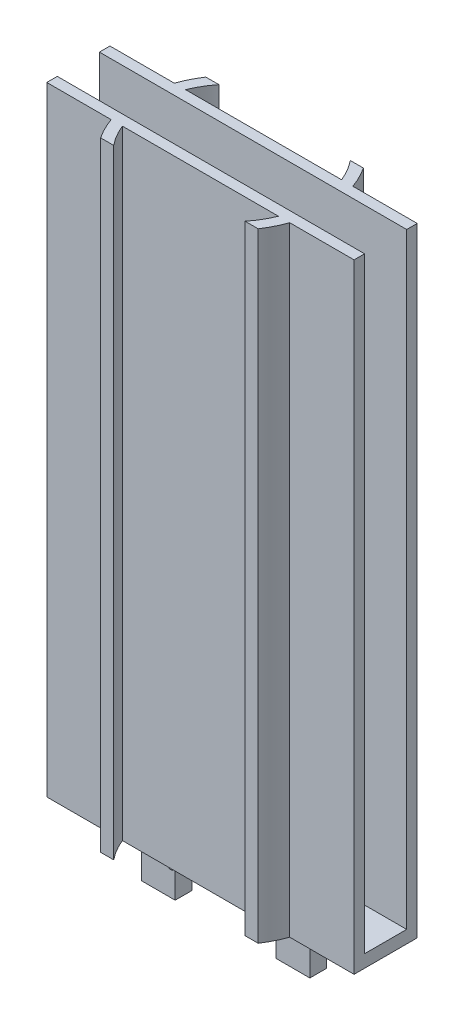
ISO-10303-21;
HEADER;
FILE_DESCRIPTION(('STEP AP214'),'2;1');
FILE_NAME('part.step','',(''),(''),'','','');
FILE_SCHEMA(('AUTOMOTIVE_DESIGN { 1 0 10303 214 1 1 1 1 }'));
ENDSEC;
DATA;
#1=APPLICATION_CONTEXT('core data for automotive mechanical design processes');
#2=APPLICATION_PROTOCOL_DEFINITION('international standard','automotive_design',2000,#1);
#3=PRODUCT_CONTEXT('',#1,'mechanical');
#4=PRODUCT('Part','Part','',(#3));
#5=PRODUCT_RELATED_PRODUCT_CATEGORY('part','',(#4));
#6=PRODUCT_DEFINITION_FORMATION('','',#4);
#7=PRODUCT_DEFINITION_CONTEXT('part definition',#1,'design');
#8=PRODUCT_DEFINITION('design','',#6,#7);
#9=PRODUCT_DEFINITION_SHAPE('','',#8);
#10=(LENGTH_UNIT() NAMED_UNIT(*) SI_UNIT(.MILLI.,.METRE.));
#11=(NAMED_UNIT(*) PLANE_ANGLE_UNIT() SI_UNIT($,.RADIAN.));
#12=(NAMED_UNIT(*) SI_UNIT($,.STERADIAN.) SOLID_ANGLE_UNIT());
#13=UNCERTAINTY_MEASURE_WITH_UNIT(LENGTH_MEASURE(1.E-05),#10,'distance_accuracy_value','');
#14=(GEOMETRIC_REPRESENTATION_CONTEXT(3) GLOBAL_UNCERTAINTY_ASSIGNED_CONTEXT((#13)) GLOBAL_UNIT_ASSIGNED_CONTEXT((#10,
#11,#12)) REPRESENTATION_CONTEXT('',''));
#15=CARTESIAN_POINT('',(0.,0.,0.));
#16=DIRECTION('',(0.,0.,1.));
#17=DIRECTION('',(1.,0.,0.));
#18=AXIS2_PLACEMENT_3D('',#15,#16,#17);
#19=CARTESIAN_POINT('',(0.,0.,0.));
#20=DIRECTION('',(0.,1.,0.));
#21=DIRECTION('',(0.,0.,1.));
#22=AXIS2_PLACEMENT_3D('',#19,#20,#21);
#23=PLANE('',#22);
#24=DIRECTION('',(0.,0.,-1.));
#25=VECTOR('',#24,1.);
#26=CARTESIAN_POINT('',(-73.,0.,0.));
#27=LINE('',#26,#25);
#28=CARTESIAN_POINT('',(-73.,0.,0.));
#29=VERTEX_POINT('',#28);
#30=CARTESIAN_POINT('',(-73.,0.,-10.));
#31=VERTEX_POINT('',#30);
#32=EDGE_CURVE('E409',#29,#31,#27,.T.);
#33=ORIENTED_EDGE('',*,*,#32,.F.);
#34=DIRECTION('',(-1.,0.,0.));
#35=VECTOR('',#34,1.);
#36=CARTESIAN_POINT('',(0.,0.,0.));
#37=LINE('',#36,#35);
#38=CARTESIAN_POINT('',(0.,0.,0.));
#39=VERTEX_POINT('',#38);
#40=EDGE_CURVE('E317',#39,#29,#37,.T.);
#41=ORIENTED_EDGE('',*,*,#40,.F.);
#42=DIRECTION('',(0.,0.,-1.));
#43=VECTOR('',#42,1.);
#44=CARTESIAN_POINT('',(0.,0.,0.));
#45=LINE('',#44,#43);
#46=CARTESIAN_POINT('',(0.,0.,-10.));
#47=VERTEX_POINT('',#46);
#48=EDGE_CURVE('E404',#39,#47,#45,.T.);
#49=ORIENTED_EDGE('',*,*,#48,.T.);
#50=DIRECTION('',(-1.,0.,0.));
#51=VECTOR('',#50,1.);
#52=CARTESIAN_POINT('',(0.,0.,-10.));
#53=LINE('',#52,#51);
#54=EDGE_CURVE('E359',#47,#31,#53,.T.);
#55=ORIENTED_EDGE('',*,*,#54,.T.);
#56=EDGE_LOOP('',(#33,#41,#49,#55));
#57=FACE_BOUND('',#56,.T.);
#58=ADVANCED_FACE('F39',(#57),#23,.T.);
#59=CARTESIAN_POINT('',(0.,-3.,2.49999999999999));
#60=DIRECTION('',(0.,0.,1.));
#61=DIRECTION('',(1.,0.,0.));
#62=AXIS2_PLACEMENT_3D('',#59,#60,#61);
#63=PLANE('',#62);
#64=DIRECTION('',(0.,1.,0.));
#65=VECTOR('',#64,1.);
#66=CARTESIAN_POINT('',(-17.9595037822608,-3.,2.49999999999999));
#67=LINE('',#66,#65);
#68=CARTESIAN_POINT('',(-17.9595037822608,-3.,2.49999999999999));
#69=VERTEX_POINT('',#68);
#70=CARTESIAN_POINT('',(-17.9595037822608,144.,2.49999999999999));
#71=VERTEX_POINT('',#70);
#72=EDGE_CURVE('E43',#69,#71,#67,.T.);
#73=ORIENTED_EDGE('',*,*,#72,.T.);
#74=DIRECTION('',(1.,0.,0.));
#75=VECTOR('',#74,1.);
#76=CARTESIAN_POINT('',(0.,144.,2.49999999999999));
#77=LINE('',#76,#75);
#78=CARTESIAN_POINT('',(-55.0404962177392,144.,2.49999999999999));
#79=VERTEX_POINT('',#78);
#80=EDGE_CURVE('E330',#79,#71,#77,.T.);
#81=ORIENTED_EDGE('',*,*,#80,.F.);
#82=DIRECTION('',(0.,1.,0.));
#83=VECTOR('',#82,1.);
#84=CARTESIAN_POINT('',(-55.0404962177392,-3.,2.49999999999999));
#85=LINE('',#84,#83);
#86=CARTESIAN_POINT('',(-55.0404962177392,-3.,2.49999999999999));
#87=VERTEX_POINT('',#86);
#88=EDGE_CURVE('E11',#87,#79,#85,.T.);
#89=ORIENTED_EDGE('',*,*,#88,.F.);
#90=DIRECTION('',(1.,0.,0.));
#91=VECTOR('',#90,1.);
#92=CARTESIAN_POINT('',(0.,-3.,2.49999999999999));
#93=LINE('',#92,#91);
#94=EDGE_CURVE('E405',#87,#69,#93,.T.);
#95=ORIENTED_EDGE('',*,*,#94,.T.);
#96=EDGE_LOOP('',(#73,#81,#89,#95));
#97=FACE_BOUND('',#96,.T.);
#98=ADVANCED_FACE('F41',(#97),#63,.T.);
#99=CARTESIAN_POINT('',(-36.5,-3.,-5.00000000000001));
#100=DIRECTION('',(0.,1.,0.));
#101=DIRECTION('',(0.,0.,1.));
#102=AXIS2_PLACEMENT_3D('',#99,#100,#101);
#103=CYLINDRICAL_SURFACE('',#102,20.);
#104=ORIENTED_EDGE('',*,*,#88,.T.);
#105=CARTESIAN_POINT('',(-36.5,144.,-5.00000000000001));
#106=DIRECTION('',(0.,1.,0.));
#107=DIRECTION('',(0.,0.,1.));
#108=AXIS2_PLACEMENT_3D('',#105,#106,#107);
#109=CIRCLE('',#108,20.);
#110=CARTESIAN_POINT('',(-52.112494995996,144.,7.49999999999999));
#111=VERTEX_POINT('',#110);
#112=EDGE_CURVE('E327',#79,#111,#109,.T.);
#113=ORIENTED_EDGE('',*,*,#112,.T.);
#114=DIRECTION('',(0.,1.,0.));
#115=VECTOR('',#114,1.);
#116=CARTESIAN_POINT('',(-52.112494995996,-3.,7.49999999999999));
#117=LINE('',#116,#115);
#118=CARTESIAN_POINT('',(-52.112494995996,-3.,7.49999999999999));
#119=VERTEX_POINT('',#118);
#120=EDGE_CURVE('E48',#119,#111,#117,.T.);
#121=ORIENTED_EDGE('',*,*,#120,.F.);
#122=CARTESIAN_POINT('',(-36.5,-3.,-5.00000000000001));
#123=DIRECTION('',(0.,1.,0.));
#124=DIRECTION('',(0.,0.,1.));
#125=AXIS2_PLACEMENT_3D('',#122,#123,#124);
#126=CIRCLE('',#125,20.);
#127=EDGE_CURVE('E454',#87,#119,#126,.T.);
#128=ORIENTED_EDGE('',*,*,#127,.F.);
#129=EDGE_LOOP('',(#104,#113,#121,#128));
#130=FACE_BOUND('',#129,.T.);
#131=ADVANCED_FACE('F521',(#130),#103,.F.);
#132=CARTESIAN_POINT('',(0.,-3.,7.49999999999998));
#133=DIRECTION('',(0.,0.,1.));
#134=DIRECTION('',(1.,0.,0.));
#135=AXIS2_PLACEMENT_3D('',#132,#133,#134);
#136=PLANE('',#135);
#137=ORIENTED_EDGE('',*,*,#120,.T.);
#138=DIRECTION('',(1.,0.,0.));
#139=VECTOR('',#138,1.);
#140=CARTESIAN_POINT('',(0.,144.,7.49999999999998));
#141=LINE('',#140,#139);
#142=CARTESIAN_POINT('',(-55.2082869338697,144.,7.49999999999999));
#143=VERTEX_POINT('',#142);
#144=EDGE_CURVE('E324',#143,#111,#141,.T.);
#145=ORIENTED_EDGE('',*,*,#144,.F.);
#146=DIRECTION('',(0.,1.,0.));
#147=VECTOR('',#146,1.);
#148=CARTESIAN_POINT('',(-55.2082869338697,-3.,7.49999999999999));
#149=LINE('',#148,#147);
#150=CARTESIAN_POINT('',(-55.2082869338697,-3.,7.49999999999999));
#151=VERTEX_POINT('',#150);
#152=EDGE_CURVE('E459',#151,#143,#149,.T.);
#153=ORIENTED_EDGE('',*,*,#152,.F.);
#154=DIRECTION('',(1.,0.,0.));
#155=VECTOR('',#154,1.);
#156=CARTESIAN_POINT('',(0.,-3.,7.49999999999998));
#157=LINE('',#156,#155);
#158=EDGE_CURVE('E451',#151,#119,#157,.T.);
#159=ORIENTED_EDGE('',*,*,#158,.T.);
#160=EDGE_LOOP('',(#137,#145,#153,#159));
#161=FACE_BOUND('',#160,.T.);
#162=ADVANCED_FACE('F527',(#161),#136,.T.);
#163=CARTESIAN_POINT('',(-36.5,-3.,-5.00000000000001));
#164=DIRECTION('',(0.,1.,0.));
#165=DIRECTION('',(0.,0.,1.));
#166=AXIS2_PLACEMENT_3D('',#163,#164,#165);
#167=CYLINDRICAL_SURFACE('',#166,22.5);
#168=ORIENTED_EDGE('',*,*,#152,.T.);
#169=CARTESIAN_POINT('',(-36.5,144.,-5.00000000000001));
#170=DIRECTION('',(0.,1.,0.));
#171=DIRECTION('',(0.,0.,1.));
#172=AXIS2_PLACEMENT_3D('',#169,#170,#171);
#173=CIRCLE('',#172,22.5);
#174=CARTESIAN_POINT('',(-57.7132034355964,144.,2.49999999999999));
#175=VERTEX_POINT('',#174);
#176=EDGE_CURVE('E321',#175,#143,#173,.T.);
#177=ORIENTED_EDGE('',*,*,#176,.F.);
#178=DIRECTION('',(0.,1.,0.));
#179=VECTOR('',#178,1.);
#180=CARTESIAN_POINT('',(-57.7132034355964,-3.,2.49999999999999));
#181=LINE('',#180,#179);
#182=CARTESIAN_POINT('',(-57.7132034355964,-3.,2.49999999999999));
#183=VERTEX_POINT('',#182);
#184=EDGE_CURVE('E461',#183,#175,#181,.T.);
#185=ORIENTED_EDGE('',*,*,#184,.F.);
#186=CARTESIAN_POINT('',(-36.5,-3.,-5.00000000000001));
#187=DIRECTION('',(0.,1.,0.));
#188=DIRECTION('',(0.,0.,1.));
#189=AXIS2_PLACEMENT_3D('',#186,#187,#188);
#190=CIRCLE('',#189,22.5);
#191=EDGE_CURVE('E448',#183,#151,#190,.T.);
#192=ORIENTED_EDGE('',*,*,#191,.T.);
#193=EDGE_LOOP('',(#168,#177,#185,#192));
#194=FACE_BOUND('',#193,.T.);
#195=ADVANCED_FACE('F531',(#194),#167,.T.);
#196=CARTESIAN_POINT('',(0.,-3.,2.49999999999999));
#197=DIRECTION('',(0.,0.,1.));
#198=DIRECTION('',(1.,0.,0.));
#199=AXIS2_PLACEMENT_3D('',#196,#197,#198);
#200=PLANE('',#199);
#201=ORIENTED_EDGE('',*,*,#184,.T.);
#202=DIRECTION('',(1.,0.,0.));
#203=VECTOR('',#202,1.);
#204=CARTESIAN_POINT('',(0.,144.,2.49999999999999));
#205=LINE('',#204,#203);
#206=CARTESIAN_POINT('',(-73.,144.,2.49999999999999));
#207=VERTEX_POINT('',#206);
#208=EDGE_CURVE('E318',#207,#175,#205,.T.);
#209=ORIENTED_EDGE('',*,*,#208,.F.);
#210=DIRECTION('',(0.,1.,0.));
#211=VECTOR('',#210,1.);
#212=CARTESIAN_POINT('',(-73.,-3.,2.49999999999999));
#213=LINE('',#212,#211);
#214=CARTESIAN_POINT('',(-73.,-3.,2.49999999999999));
#215=VERTEX_POINT('',#214);
#216=EDGE_CURVE('E463',#215,#207,#213,.T.);
#217=ORIENTED_EDGE('',*,*,#216,.F.);
#218=DIRECTION('',(1.,0.,0.));
#219=VECTOR('',#218,1.);
#220=CARTESIAN_POINT('',(0.,-3.,2.49999999999999));
#221=LINE('',#220,#219);
#222=EDGE_CURVE('E445',#215,#183,#221,.T.);
#223=ORIENTED_EDGE('',*,*,#222,.T.);
#224=EDGE_LOOP('',(#201,#209,#217,#223));
#225=FACE_BOUND('',#224,.T.);
#226=ADVANCED_FACE('F535',(#225),#200,.T.);
#227=CARTESIAN_POINT('',(-73.,-3.,0.));
#228=DIRECTION('',(1.,0.,0.));
#229=DIRECTION('',(0.,0.,-1.));
#230=AXIS2_PLACEMENT_3D('',#227,#228,#229);
#231=PLANE('',#230);
#232=ORIENTED_EDGE('',*,*,#216,.T.);
#233=DIRECTION('',(0.,0.,1.));
#234=VECTOR('',#233,1.);
#235=CARTESIAN_POINT('',(-73.,144.,0.));
#236=LINE('',#235,#234);
#237=CARTESIAN_POINT('',(-73.,144.,0.));
#238=VERTEX_POINT('',#237);
#239=EDGE_CURVE('E350',#238,#207,#236,.T.);
#240=ORIENTED_EDGE('',*,*,#239,.F.);
#241=DIRECTION('',(0.,-1.,0.));
#242=VECTOR('',#241,1.);
#243=CARTESIAN_POINT('',(-73.,144.,0.));
#244=LINE('',#243,#242);
#245=EDGE_CURVE('E353',#238,#29,#244,.T.);
#246=ORIENTED_EDGE('',*,*,#245,.T.);
#247=ORIENTED_EDGE('',*,*,#32,.T.);
#248=DIRECTION('',(0.,-1.,0.));
#249=VECTOR('',#248,1.);
#250=CARTESIAN_POINT('',(-73.,144.,-10.));
#251=LINE('',#250,#249);
#252=CARTESIAN_POINT('',(-73.,144.,-10.));
#253=VERTEX_POINT('',#252);
#254=EDGE_CURVE('E396',#253,#31,#251,.T.);
#255=ORIENTED_EDGE('',*,*,#254,.F.);
#256=DIRECTION('',(0.,0.,-1.));
#257=VECTOR('',#256,1.);
#258=CARTESIAN_POINT('',(-73.,144.,0.));
#259=LINE('',#258,#257);
#260=CARTESIAN_POINT('',(-73.,144.,-12.5));
#261=VERTEX_POINT('',#260);
#262=EDGE_CURVE('E393',#253,#261,#259,.T.);
#263=ORIENTED_EDGE('',*,*,#262,.T.);
#264=DIRECTION('',(0.,1.,0.));
#265=VECTOR('',#264,1.);
#266=CARTESIAN_POINT('',(-73.,-3.,-12.5));
#267=LINE('',#266,#265);
#268=CARTESIAN_POINT('',(-73.,-3.,-12.5));
#269=VERTEX_POINT('',#268);
#270=EDGE_CURVE('E465',#269,#261,#267,.T.);
#271=ORIENTED_EDGE('',*,*,#270,.F.);
#272=DIRECTION('',(0.,0.,-1.));
#273=VECTOR('',#272,1.);
#274=CARTESIAN_POINT('',(-73.,-3.,0.));
#275=LINE('',#274,#273);
#276=EDGE_CURVE('E443',#215,#269,#275,.T.);
#277=ORIENTED_EDGE('',*,*,#276,.F.);
#278=EDGE_LOOP('',(#232,#240,#246,#247,#255,#263,#271,#277));
#279=FACE_BOUND('',#278,.T.);
#280=ADVANCED_FACE('F539',(#279),#231,.F.);
#281=CARTESIAN_POINT('',(0.,-3.,-12.5));
#282=DIRECTION('',(0.,0.,1.));
#283=DIRECTION('',(1.,0.,0.));
#284=AXIS2_PLACEMENT_3D('',#281,#282,#283);
#285=PLANE('',#284);
#286=ORIENTED_EDGE('',*,*,#270,.T.);
#287=DIRECTION('',(1.,0.,0.));
#288=VECTOR('',#287,1.);
#289=CARTESIAN_POINT('',(0.,144.,-12.5));
#290=LINE('',#289,#288);
#291=CARTESIAN_POINT('',(-57.7132034355964,144.,-12.5));
#292=VERTEX_POINT('',#291);
#293=EDGE_CURVE('E390',#261,#292,#290,.T.);
#294=ORIENTED_EDGE('',*,*,#293,.T.);
#295=DIRECTION('',(0.,1.,0.));
#296=VECTOR('',#295,1.);
#297=CARTESIAN_POINT('',(-57.7132034355964,-3.,-12.5));
#298=LINE('',#297,#296);
#299=CARTESIAN_POINT('',(-57.7132034355964,-3.,-12.5));
#300=VERTEX_POINT('',#299);
#301=EDGE_CURVE('E467',#300,#292,#298,.T.);
#302=ORIENTED_EDGE('',*,*,#301,.F.);
#303=DIRECTION('',(1.,0.,0.));
#304=VECTOR('',#303,1.);
#305=CARTESIAN_POINT('',(0.,-3.,-12.5));
#306=LINE('',#305,#304);
#307=EDGE_CURVE('E441',#269,#300,#306,.T.);
#308=ORIENTED_EDGE('',*,*,#307,.F.);
#309=EDGE_LOOP('',(#286,#294,#302,#308));
#310=FACE_BOUND('',#309,.T.);
#311=ADVANCED_FACE('F543',(#310),#285,.F.);
#312=CARTESIAN_POINT('',(-36.5,-3.,-5.00000000000001));
#313=DIRECTION('',(0.,1.,0.));
#314=DIRECTION('',(0.,0.,1.));
#315=AXIS2_PLACEMENT_3D('',#312,#313,#314);
#316=CYLINDRICAL_SURFACE('',#315,22.5);
#317=ORIENTED_EDGE('',*,*,#301,.T.);
#318=CARTESIAN_POINT('',(-36.5,144.,-5.00000000000001));
#319=DIRECTION('',(0.,1.,0.));
#320=DIRECTION('',(0.,0.,1.));
#321=AXIS2_PLACEMENT_3D('',#318,#319,#320);
#322=CIRCLE('',#321,22.5);
#323=CARTESIAN_POINT('',(-55.2082869338697,144.,-17.5));
#324=VERTEX_POINT('',#323);
#325=EDGE_CURVE('E387',#324,#292,#322,.T.);
#326=ORIENTED_EDGE('',*,*,#325,.F.);
#327=DIRECTION('',(0.,1.,0.));
#328=VECTOR('',#327,1.);
#329=CARTESIAN_POINT('',(-55.2082869338697,-3.,-17.5));
#330=LINE('',#329,#328);
#331=CARTESIAN_POINT('',(-55.2082869338697,-3.,-17.5));
#332=VERTEX_POINT('',#331);
#333=EDGE_CURVE('E469',#332,#324,#330,.T.);
#334=ORIENTED_EDGE('',*,*,#333,.F.);
#335=CARTESIAN_POINT('',(-36.5,-3.,-5.00000000000001));
#336=DIRECTION('',(0.,1.,0.));
#337=DIRECTION('',(0.,0.,1.));
#338=AXIS2_PLACEMENT_3D('',#335,#336,#337);
#339=CIRCLE('',#338,22.5);
#340=EDGE_CURVE('E438',#332,#300,#339,.T.);
#341=ORIENTED_EDGE('',*,*,#340,.T.);
#342=EDGE_LOOP('',(#317,#326,#334,#341));
#343=FACE_BOUND('',#342,.T.);
#344=ADVANCED_FACE('F547',(#343),#316,.T.);
#345=CARTESIAN_POINT('',(0.,-3.,-17.5));
#346=DIRECTION('',(0.,0.,1.));
#347=DIRECTION('',(1.,0.,0.));
#348=AXIS2_PLACEMENT_3D('',#345,#346,#347);
#349=PLANE('',#348);
#350=ORIENTED_EDGE('',*,*,#333,.T.);
#351=DIRECTION('',(1.,0.,0.));
#352=VECTOR('',#351,1.);
#353=CARTESIAN_POINT('',(0.,144.,-17.5));
#354=LINE('',#353,#352);
#355=CARTESIAN_POINT('',(-52.112494995996,144.,-17.5));
#356=VERTEX_POINT('',#355);
#357=EDGE_CURVE('E384',#324,#356,#354,.T.);
#358=ORIENTED_EDGE('',*,*,#357,.T.);
#359=DIRECTION('',(0.,1.,0.));
#360=VECTOR('',#359,1.);
#361=CARTESIAN_POINT('',(-52.112494995996,-3.,-17.5));
#362=LINE('',#361,#360);
#363=CARTESIAN_POINT('',(-52.112494995996,-3.,-17.5));
#364=VERTEX_POINT('',#363);
#365=EDGE_CURVE('E471',#364,#356,#362,.T.);
#366=ORIENTED_EDGE('',*,*,#365,.F.);
#367=DIRECTION('',(1.,0.,0.));
#368=VECTOR('',#367,1.);
#369=CARTESIAN_POINT('',(0.,-3.,-17.5));
#370=LINE('',#369,#368);
#371=EDGE_CURVE('E436',#332,#364,#370,.T.);
#372=ORIENTED_EDGE('',*,*,#371,.F.);
#373=EDGE_LOOP('',(#350,#358,#366,#372));
#374=FACE_BOUND('',#373,.T.);
#375=ADVANCED_FACE('F551',(#374),#349,.F.);
#376=CARTESIAN_POINT('',(-36.5,-3.,-5.00000000000001));
#377=DIRECTION('',(0.,1.,0.));
#378=DIRECTION('',(0.,0.,1.));
#379=AXIS2_PLACEMENT_3D('',#376,#377,#378);
#380=CYLINDRICAL_SURFACE('',#379,20.);
#381=ORIENTED_EDGE('',*,*,#365,.T.);
#382=CARTESIAN_POINT('',(-36.5,144.,-5.00000000000001));
#383=DIRECTION('',(0.,1.,0.));
#384=DIRECTION('',(0.,0.,1.));
#385=AXIS2_PLACEMENT_3D('',#382,#383,#384);
#386=CIRCLE('',#385,20.);
#387=CARTESIAN_POINT('',(-55.0404962177392,144.,-12.5));
#388=VERTEX_POINT('',#387);
#389=EDGE_CURVE('E381',#356,#388,#386,.T.);
#390=ORIENTED_EDGE('',*,*,#389,.T.);
#391=DIRECTION('',(0.,1.,0.));
#392=VECTOR('',#391,1.);
#393=CARTESIAN_POINT('',(-55.0404962177392,-3.,-12.5));
#394=LINE('',#393,#392);
#395=CARTESIAN_POINT('',(-55.0404962177392,-3.,-12.5));
#396=VERTEX_POINT('',#395);
#397=EDGE_CURVE('E473',#396,#388,#394,.T.);
#398=ORIENTED_EDGE('',*,*,#397,.F.);
#399=CARTESIAN_POINT('',(-36.5,-3.,-5.00000000000001));
#400=DIRECTION('',(0.,1.,0.));
#401=DIRECTION('',(0.,0.,1.));
#402=AXIS2_PLACEMENT_3D('',#399,#400,#401);
#403=CIRCLE('',#402,20.);
#404=EDGE_CURVE('E434',#364,#396,#403,.T.);
#405=ORIENTED_EDGE('',*,*,#404,.F.);
#406=EDGE_LOOP('',(#381,#390,#398,#405));
#407=FACE_BOUND('',#406,.T.);
#408=ADVANCED_FACE('F555',(#407),#380,.F.);
#409=CARTESIAN_POINT('',(0.,-3.,-12.5));
#410=DIRECTION('',(0.,0.,1.));
#411=DIRECTION('',(1.,0.,0.));
#412=AXIS2_PLACEMENT_3D('',#409,#410,#411);
#413=PLANE('',#412);
#414=ORIENTED_EDGE('',*,*,#397,.T.);
#415=DIRECTION('',(1.,0.,0.));
#416=VECTOR('',#415,1.);
#417=CARTESIAN_POINT('',(0.,144.,-12.5));
#418=LINE('',#417,#416);
#419=CARTESIAN_POINT('',(-17.9595037822608,144.,-12.5));
#420=VERTEX_POINT('',#419);
#421=EDGE_CURVE('E378',#388,#420,#418,.T.);
#422=ORIENTED_EDGE('',*,*,#421,.T.);
#423=DIRECTION('',(0.,1.,0.));
#424=VECTOR('',#423,1.);
#425=CARTESIAN_POINT('',(-17.9595037822608,-3.,-12.5));
#426=LINE('',#425,#424);
#427=CARTESIAN_POINT('',(-17.9595037822608,-3.,-12.5));
#428=VERTEX_POINT('',#427);
#429=EDGE_CURVE('E475',#428,#420,#426,.T.);
#430=ORIENTED_EDGE('',*,*,#429,.F.);
#431=DIRECTION('',(1.,0.,0.));
#432=VECTOR('',#431,1.);
#433=CARTESIAN_POINT('',(0.,-3.,-12.5));
#434=LINE('',#433,#432);
#435=EDGE_CURVE('E432',#396,#428,#434,.T.);
#436=ORIENTED_EDGE('',*,*,#435,.F.);
#437=EDGE_LOOP('',(#414,#422,#430,#436));
#438=FACE_BOUND('',#437,.T.);
#439=ADVANCED_FACE('F559',(#438),#413,.F.);
#440=CARTESIAN_POINT('',(-36.5,-3.,-5.00000000000001));
#441=DIRECTION('',(0.,1.,0.));
#442=DIRECTION('',(0.,0.,1.));
#443=AXIS2_PLACEMENT_3D('',#440,#441,#442);
#444=CYLINDRICAL_SURFACE('',#443,20.);
#445=ORIENTED_EDGE('',*,*,#429,.T.);
#446=CARTESIAN_POINT('',(-36.5,144.,-5.00000000000001));
#447=DIRECTION('',(0.,1.,0.));
#448=DIRECTION('',(0.,0.,1.));
#449=AXIS2_PLACEMENT_3D('',#446,#447,#448);
#450=CIRCLE('',#449,20.);
#451=CARTESIAN_POINT('',(-20.887505004004,144.,-17.5));
#452=VERTEX_POINT('',#451);
#453=EDGE_CURVE('E375',#420,#452,#450,.T.);
#454=ORIENTED_EDGE('',*,*,#453,.T.);
#455=DIRECTION('',(0.,1.,0.));
#456=VECTOR('',#455,1.);
#457=CARTESIAN_POINT('',(-20.887505004004,-3.,-17.5));
#458=LINE('',#457,#456);
#459=CARTESIAN_POINT('',(-20.887505004004,-3.,-17.5));
#460=VERTEX_POINT('',#459);
#461=EDGE_CURVE('E477',#460,#452,#458,.T.);
#462=ORIENTED_EDGE('',*,*,#461,.F.);
#463=CARTESIAN_POINT('',(-36.5,-3.,-5.00000000000001));
#464=DIRECTION('',(0.,1.,0.));
#465=DIRECTION('',(0.,0.,1.));
#466=AXIS2_PLACEMENT_3D('',#463,#464,#465);
#467=CIRCLE('',#466,20.);
#468=EDGE_CURVE('E430',#428,#460,#467,.T.);
#469=ORIENTED_EDGE('',*,*,#468,.F.);
#470=EDGE_LOOP('',(#445,#454,#462,#469));
#471=FACE_BOUND('',#470,.T.);
#472=ADVANCED_FACE('F563',(#471),#444,.F.);
#473=CARTESIAN_POINT('',(0.,-3.,-17.5));
#474=DIRECTION('',(0.,0.,1.));
#475=DIRECTION('',(1.,0.,0.));
#476=AXIS2_PLACEMENT_3D('',#473,#474,#475);
#477=PLANE('',#476);
#478=ORIENTED_EDGE('',*,*,#461,.T.);
#479=DIRECTION('',(1.,0.,0.));
#480=VECTOR('',#479,1.);
#481=CARTESIAN_POINT('',(0.,144.,-17.5));
#482=LINE('',#481,#480);
#483=CARTESIAN_POINT('',(-17.7917130661303,144.,-17.5));
#484=VERTEX_POINT('',#483);
#485=EDGE_CURVE('E372',#452,#484,#482,.T.);
#486=ORIENTED_EDGE('',*,*,#485,.T.);
#487=DIRECTION('',(0.,1.,0.));
#488=VECTOR('',#487,1.);
#489=CARTESIAN_POINT('',(-17.7917130661303,-3.,-17.5));
#490=LINE('',#489,#488);
#491=CARTESIAN_POINT('',(-17.7917130661303,-3.,-17.5));
#492=VERTEX_POINT('',#491);
#493=EDGE_CURVE('E479',#492,#484,#490,.T.);
#494=ORIENTED_EDGE('',*,*,#493,.F.);
#495=DIRECTION('',(1.,0.,0.));
#496=VECTOR('',#495,1.);
#497=CARTESIAN_POINT('',(0.,-3.,-17.5));
#498=LINE('',#497,#496);
#499=EDGE_CURVE('E428',#460,#492,#498,.T.);
#500=ORIENTED_EDGE('',*,*,#499,.F.);
#501=EDGE_LOOP('',(#478,#486,#494,#500));
#502=FACE_BOUND('',#501,.T.);
#503=ADVANCED_FACE('F567',(#502),#477,.F.);
#504=CARTESIAN_POINT('',(-36.5,-3.,-5.00000000000001));
#505=DIRECTION('',(0.,1.,0.));
#506=DIRECTION('',(0.,0.,1.));
#507=AXIS2_PLACEMENT_3D('',#504,#505,#506);
#508=CYLINDRICAL_SURFACE('',#507,22.5);
#509=ORIENTED_EDGE('',*,*,#493,.T.);
#510=CARTESIAN_POINT('',(-36.5,144.,-5.00000000000001));
#511=DIRECTION('',(0.,1.,0.));
#512=DIRECTION('',(0.,0.,1.));
#513=AXIS2_PLACEMENT_3D('',#510,#511,#512);
#514=CIRCLE('',#513,22.5);
#515=CARTESIAN_POINT('',(-15.2867965644036,144.,-12.5));
#516=VERTEX_POINT('',#515);
#517=EDGE_CURVE('E369',#516,#484,#514,.T.);
#518=ORIENTED_EDGE('',*,*,#517,.F.);
#519=DIRECTION('',(0.,1.,0.));
#520=VECTOR('',#519,1.);
#521=CARTESIAN_POINT('',(-15.2867965644036,-3.,-12.5));
#522=LINE('',#521,#520);
#523=CARTESIAN_POINT('',(-15.2867965644036,-3.,-12.5));
#524=VERTEX_POINT('',#523);
#525=EDGE_CURVE('E481',#524,#516,#522,.T.);
#526=ORIENTED_EDGE('',*,*,#525,.F.);
#527=CARTESIAN_POINT('',(-36.5,-3.,-5.00000000000001));
#528=DIRECTION('',(0.,1.,0.));
#529=DIRECTION('',(0.,0.,1.));
#530=AXIS2_PLACEMENT_3D('',#527,#528,#529);
#531=CIRCLE('',#530,22.5);
#532=EDGE_CURVE('E425',#524,#492,#531,.T.);
#533=ORIENTED_EDGE('',*,*,#532,.T.);
#534=EDGE_LOOP('',(#509,#518,#526,#533));
#535=FACE_BOUND('',#534,.T.);
#536=ADVANCED_FACE('F571',(#535),#508,.T.);
#537=CARTESIAN_POINT('',(0.,-3.,-12.5));
#538=DIRECTION('',(0.,0.,1.));
#539=DIRECTION('',(1.,0.,0.));
#540=AXIS2_PLACEMENT_3D('',#537,#538,#539);
#541=PLANE('',#540);
#542=ORIENTED_EDGE('',*,*,#525,.T.);
#543=DIRECTION('',(1.,0.,0.));
#544=VECTOR('',#543,1.);
#545=CARTESIAN_POINT('',(0.,144.,-12.5));
#546=LINE('',#545,#544);
#547=CARTESIAN_POINT('',(0.,144.,-12.5));
#548=VERTEX_POINT('',#547);
#549=EDGE_CURVE('E366',#516,#548,#546,.T.);
#550=ORIENTED_EDGE('',*,*,#549,.T.);
#551=DIRECTION('',(0.,1.,0.));
#552=VECTOR('',#551,1.);
#553=CARTESIAN_POINT('',(0.,-3.,-12.5));
#554=LINE('',#553,#552);
#555=CARTESIAN_POINT('',(0.,-3.,-12.5));
#556=VERTEX_POINT('',#555);
#557=EDGE_CURVE('E483',#556,#548,#554,.T.);
#558=ORIENTED_EDGE('',*,*,#557,.F.);
#559=DIRECTION('',(1.,0.,0.));
#560=VECTOR('',#559,1.);
#561=CARTESIAN_POINT('',(0.,-3.,-12.5));
#562=LINE('',#561,#560);
#563=EDGE_CURVE('E423',#524,#556,#562,.T.);
#564=ORIENTED_EDGE('',*,*,#563,.F.);
#565=EDGE_LOOP('',(#542,#550,#558,#564));
#566=FACE_BOUND('',#565,.T.);
#567=ADVANCED_FACE('F575',(#566),#541,.F.);
#568=CARTESIAN_POINT('',(0.,-3.,0.));
#569=DIRECTION('',(1.,0.,0.));
#570=DIRECTION('',(0.,0.,-1.));
#571=AXIS2_PLACEMENT_3D('',#568,#569,#570);
#572=PLANE('',#571);
#573=ORIENTED_EDGE('',*,*,#48,.F.);
#574=DIRECTION('',(0.,-1.,0.));
#575=VECTOR('',#574,1.);
#576=CARTESIAN_POINT('',(0.,144.,0.));
#577=LINE('',#576,#575);
#578=CARTESIAN_POINT('',(0.,144.,0.));
#579=VERTEX_POINT('',#578);
#580=EDGE_CURVE('E357',#579,#39,#577,.T.);
#581=ORIENTED_EDGE('',*,*,#580,.F.);
#582=DIRECTION('',(0.,0.,1.));
#583=VECTOR('',#582,1.);
#584=CARTESIAN_POINT('',(0.,144.,0.));
#585=LINE('',#584,#583);
#586=CARTESIAN_POINT('',(0.,144.,2.49999999999999));
#587=VERTEX_POINT('',#586);
#588=EDGE_CURVE('E345',#579,#587,#585,.T.);
#589=ORIENTED_EDGE('',*,*,#588,.T.);
#590=DIRECTION('',(0.,1.,0.));
#591=VECTOR('',#590,1.);
#592=CARTESIAN_POINT('',(0.,-3.,2.49999999999999));
#593=LINE('',#592,#591);
#594=CARTESIAN_POINT('',(0.,-3.,2.49999999999999));
#595=VERTEX_POINT('',#594);
#596=EDGE_CURVE('E485',#595,#587,#593,.T.);
#597=ORIENTED_EDGE('',*,*,#596,.F.);
#598=DIRECTION('',(0.,0.,-1.));
#599=VECTOR('',#598,1.);
#600=CARTESIAN_POINT('',(0.,-3.,0.));
#601=LINE('',#600,#599);
#602=EDGE_CURVE('E420',#595,#556,#601,.T.);
#603=ORIENTED_EDGE('',*,*,#602,.T.);
#604=ORIENTED_EDGE('',*,*,#557,.T.);
#605=DIRECTION('',(0.,0.,-1.));
#606=VECTOR('',#605,1.);
#607=CARTESIAN_POINT('',(0.,144.,0.));
#608=LINE('',#607,#606);
#609=CARTESIAN_POINT('',(0.,144.,-10.));
#610=VERTEX_POINT('',#609);
#611=EDGE_CURVE('E363',#610,#548,#608,.T.);
#612=ORIENTED_EDGE('',*,*,#611,.F.);
#613=DIRECTION('',(0.,-1.,0.));
#614=VECTOR('',#613,1.);
#615=CARTESIAN_POINT('',(0.,144.,-10.));
#616=LINE('',#615,#614);
#617=EDGE_CURVE('E401',#610,#47,#616,.T.);
#618=ORIENTED_EDGE('',*,*,#617,.T.);
#619=EDGE_LOOP('',(#573,#581,#589,#597,#603,#604,#612,#618));
#620=FACE_BOUND('',#619,.T.);
#621=ADVANCED_FACE('F579',(#620),#572,.T.);
#622=CARTESIAN_POINT('',(0.,-3.,2.49999999999999));
#623=DIRECTION('',(0.,0.,1.));
#624=DIRECTION('',(1.,0.,0.));
#625=AXIS2_PLACEMENT_3D('',#622,#623,#624);
#626=PLANE('',#625);
#627=ORIENTED_EDGE('',*,*,#596,.T.);
#628=DIRECTION('',(1.,0.,0.));
#629=VECTOR('',#628,1.);
#630=CARTESIAN_POINT('',(0.,144.,2.49999999999999));
#631=LINE('',#630,#629);
#632=CARTESIAN_POINT('',(-15.2867965644036,144.,2.49999999999999));
#633=VERTEX_POINT('',#632);
#634=EDGE_CURVE('E342',#633,#587,#631,.T.);
#635=ORIENTED_EDGE('',*,*,#634,.F.);
#636=DIRECTION('',(0.,1.,0.));
#637=VECTOR('',#636,1.);
#638=CARTESIAN_POINT('',(-15.2867965644036,-3.,2.49999999999999));
#639=LINE('',#638,#637);
#640=CARTESIAN_POINT('',(-15.2867965644036,-3.,2.49999999999999));
#641=VERTEX_POINT('',#640);
#642=EDGE_CURVE('E487',#641,#633,#639,.T.);
#643=ORIENTED_EDGE('',*,*,#642,.F.);
#644=DIRECTION('',(1.,0.,0.));
#645=VECTOR('',#644,1.);
#646=CARTESIAN_POINT('',(0.,-3.,2.49999999999999));
#647=LINE('',#646,#645);
#648=EDGE_CURVE('E417',#641,#595,#647,.T.);
#649=ORIENTED_EDGE('',*,*,#648,.T.);
#650=EDGE_LOOP('',(#627,#635,#643,#649));
#651=FACE_BOUND('',#650,.T.);
#652=ADVANCED_FACE('F583',(#651),#626,.T.);
#653=CARTESIAN_POINT('',(-36.5,-3.,-5.00000000000001));
#654=DIRECTION('',(0.,1.,0.));
#655=DIRECTION('',(0.,0.,1.));
#656=AXIS2_PLACEMENT_3D('',#653,#654,#655);
#657=CYLINDRICAL_SURFACE('',#656,22.5);
#658=ORIENTED_EDGE('',*,*,#642,.T.);
#659=CARTESIAN_POINT('',(-36.5,144.,-5.00000000000001));
#660=DIRECTION('',(0.,1.,0.));
#661=DIRECTION('',(0.,0.,1.));
#662=AXIS2_PLACEMENT_3D('',#659,#660,#661);
#663=CIRCLE('',#662,22.5);
#664=CARTESIAN_POINT('',(-17.7917130661303,144.,7.49999999999999));
#665=VERTEX_POINT('',#664);
#666=EDGE_CURVE('E339',#665,#633,#663,.T.);
#667=ORIENTED_EDGE('',*,*,#666,.F.);
#668=DIRECTION('',(0.,1.,0.));
#669=VECTOR('',#668,1.);
#670=CARTESIAN_POINT('',(-17.7917130661303,-3.,7.49999999999999));
#671=LINE('',#670,#669);
#672=CARTESIAN_POINT('',(-17.7917130661303,-3.,7.49999999999999));
#673=VERTEX_POINT('',#672);
#674=EDGE_CURVE('E489',#673,#665,#671,.T.);
#675=ORIENTED_EDGE('',*,*,#674,.F.);
#676=CARTESIAN_POINT('',(-36.5,-3.,-5.00000000000001));
#677=DIRECTION('',(0.,1.,0.));
#678=DIRECTION('',(0.,0.,1.));
#679=AXIS2_PLACEMENT_3D('',#676,#677,#678);
#680=CIRCLE('',#679,22.5);
#681=EDGE_CURVE('E414',#673,#641,#680,.T.);
#682=ORIENTED_EDGE('',*,*,#681,.T.);
#683=EDGE_LOOP('',(#658,#667,#675,#682));
#684=FACE_BOUND('',#683,.T.);
#685=ADVANCED_FACE('F512',(#684),#657,.T.);
#686=CARTESIAN_POINT('',(0.,-3.,7.49999999999998));
#687=DIRECTION('',(0.,0.,1.));
#688=DIRECTION('',(1.,0.,0.));
#689=AXIS2_PLACEMENT_3D('',#686,#687,#688);
#690=PLANE('',#689);
#691=ORIENTED_EDGE('',*,*,#674,.T.);
#692=DIRECTION('',(1.,0.,0.));
#693=VECTOR('',#692,1.);
#694=CARTESIAN_POINT('',(0.,144.,7.49999999999998));
#695=LINE('',#694,#693);
#696=CARTESIAN_POINT('',(-20.887505004004,144.,7.49999999999999));
#697=VERTEX_POINT('',#696);
#698=EDGE_CURVE('E336',#697,#665,#695,.T.);
#699=ORIENTED_EDGE('',*,*,#698,.F.);
#700=DIRECTION('',(0.,1.,0.));
#701=VECTOR('',#700,1.);
#702=CARTESIAN_POINT('',(-20.887505004004,-3.,7.49999999999999));
#703=LINE('',#702,#701);
#704=CARTESIAN_POINT('',(-20.887505004004,-3.,7.49999999999999));
#705=VERTEX_POINT('',#704);
#706=EDGE_CURVE('E490',#705,#697,#703,.T.);
#707=ORIENTED_EDGE('',*,*,#706,.F.);
#708=DIRECTION('',(1.,0.,0.));
#709=VECTOR('',#708,1.);
#710=CARTESIAN_POINT('',(0.,-3.,7.49999999999998));
#711=LINE('',#710,#709);
#712=EDGE_CURVE('E411',#705,#673,#711,.T.);
#713=ORIENTED_EDGE('',*,*,#712,.T.);
#714=EDGE_LOOP('',(#691,#699,#707,#713));
#715=FACE_BOUND('',#714,.T.);
#716=ADVANCED_FACE('F505',(#715),#690,.T.);
#717=CARTESIAN_POINT('',(-36.5,-3.,-5.00000000000001));
#718=DIRECTION('',(0.,1.,0.));
#719=DIRECTION('',(0.,0.,1.));
#720=AXIS2_PLACEMENT_3D('',#717,#718,#719);
#721=CYLINDRICAL_SURFACE('',#720,20.);
#722=ORIENTED_EDGE('',*,*,#706,.T.);
#723=CARTESIAN_POINT('',(-36.5,144.,-5.00000000000001));
#724=DIRECTION('',(0.,1.,0.));
#725=DIRECTION('',(0.,0.,1.));
#726=AXIS2_PLACEMENT_3D('',#723,#724,#725);
#727=CIRCLE('',#726,20.);
#728=EDGE_CURVE('E333',#697,#71,#727,.T.);
#729=ORIENTED_EDGE('',*,*,#728,.T.);
#730=ORIENTED_EDGE('',*,*,#72,.F.);
#731=CARTESIAN_POINT('',(-36.5,-3.,-5.00000000000001));
#732=DIRECTION('',(0.,1.,0.));
#733=DIRECTION('',(0.,0.,1.));
#734=AXIS2_PLACEMENT_3D('',#731,#732,#733);
#735=CIRCLE('',#734,20.);
#736=EDGE_CURVE('E408',#705,#69,#735,.T.);
#737=ORIENTED_EDGE('',*,*,#736,.F.);
#738=EDGE_LOOP('',(#722,#729,#730,#737));
#739=FACE_BOUND('',#738,.T.);
#740=ADVANCED_FACE('F502',(#739),#721,.F.);
#741=CARTESIAN_POINT('',(0.,-3.,0.));
#742=DIRECTION('',(0.,1.,0.));
#743=DIRECTION('',(0.,0.,1.));
#744=AXIS2_PLACEMENT_3D('',#741,#742,#743);
#745=PLANE('',#744);
#746=DIRECTION('',(1.,0.,0.));
#747=VECTOR('',#746,1.);
#748=CARTESIAN_POINT('',(0.,-3.,-3.50000000000001));
#749=LINE('',#748,#747);
#750=CARTESIAN_POINT('',(-24.5,-3.,-3.50000000000001));
#751=VERTEX_POINT('',#750);
#752=CARTESIAN_POINT('',(-16.5,-3.,-3.50000000000001));
#753=VERTEX_POINT('',#752);
#754=EDGE_CURVE('E56',#751,#753,#749,.T.);
#755=ORIENTED_EDGE('',*,*,#754,.T.);
#756=DIRECTION('',(0.,0.,-1.));
#757=VECTOR('',#756,1.);
#758=CARTESIAN_POINT('',(-16.5,-3.,0.));
#759=LINE('',#758,#757);
#760=CARTESIAN_POINT('',(-16.5,-3.,-7.50000000000001));
#761=VERTEX_POINT('',#760);
#762=EDGE_CURVE('E253',#753,#761,#759,.T.);
#763=ORIENTED_EDGE('',*,*,#762,.T.);
#764=DIRECTION('',(1.,0.,0.));
#765=VECTOR('',#764,1.);
#766=CARTESIAN_POINT('',(0.,-3.,-7.50000000000001));
#767=LINE('',#766,#765);
#768=CARTESIAN_POINT('',(-24.5,-3.,-7.50000000000001));
#769=VERTEX_POINT('',#768);
#770=EDGE_CURVE('E266',#769,#761,#767,.T.);
#771=ORIENTED_EDGE('',*,*,#770,.F.);
#772=DIRECTION('',(0.,0.,-1.));
#773=VECTOR('',#772,1.);
#774=CARTESIAN_POINT('',(-24.5,-3.,0.));
#775=LINE('',#774,#773);
#776=EDGE_CURVE('E61',#751,#769,#775,.T.);
#777=ORIENTED_EDGE('',*,*,#776,.F.);
#778=EDGE_LOOP('',(#755,#763,#771,#777));
#779=FACE_BOUND('',#778,.T.);
#780=DIRECTION('',(-1.,0.,0.));
#781=VECTOR('',#780,1.);
#782=CARTESIAN_POINT('',(0.,-3.,-3.5));
#783=LINE('',#782,#781);
#784=CARTESIAN_POINT('',(-48.5,-3.,-3.50000000000001));
#785=VERTEX_POINT('',#784);
#786=CARTESIAN_POINT('',(-56.5,-3.,-3.50000000000001));
#787=VERTEX_POINT('',#786);
#788=EDGE_CURVE('E302',#785,#787,#783,.T.);
#789=ORIENTED_EDGE('',*,*,#788,.F.);
#790=DIRECTION('',(0.,0.,-1.));
#791=VECTOR('',#790,1.);
#792=CARTESIAN_POINT('',(-48.5,-3.,0.));
#793=LINE('',#792,#791);
#794=CARTESIAN_POINT('',(-48.5,-3.,-7.50000000000001));
#795=VERTEX_POINT('',#794);
#796=EDGE_CURVE('E256',#785,#795,#793,.T.);
#797=ORIENTED_EDGE('',*,*,#796,.T.);
#798=DIRECTION('',(-1.,0.,0.));
#799=VECTOR('',#798,1.);
#800=CARTESIAN_POINT('',(0.,-3.,-7.49999999999999));
#801=LINE('',#800,#799);
#802=CARTESIAN_POINT('',(-56.5,-3.,-7.50000000000001));
#803=VERTEX_POINT('',#802);
#804=EDGE_CURVE('E292',#795,#803,#801,.T.);
#805=ORIENTED_EDGE('',*,*,#804,.T.);
#806=DIRECTION('',(0.,0.,-1.));
#807=VECTOR('',#806,1.);
#808=CARTESIAN_POINT('',(-56.5,-3.,0.));
#809=LINE('',#808,#807);
#810=EDGE_CURVE('E304',#787,#803,#809,.T.);
#811=ORIENTED_EDGE('',*,*,#810,.F.);
#812=EDGE_LOOP('',(#789,#797,#805,#811));
#813=FACE_BOUND('',#812,.T.);
#814=ORIENTED_EDGE('',*,*,#94,.F.);
#815=ORIENTED_EDGE('',*,*,#127,.T.);
#816=ORIENTED_EDGE('',*,*,#158,.F.);
#817=ORIENTED_EDGE('',*,*,#191,.F.);
#818=ORIENTED_EDGE('',*,*,#222,.F.);
#819=ORIENTED_EDGE('',*,*,#276,.T.);
#820=ORIENTED_EDGE('',*,*,#307,.T.);
#821=ORIENTED_EDGE('',*,*,#340,.F.);
#822=ORIENTED_EDGE('',*,*,#371,.T.);
#823=ORIENTED_EDGE('',*,*,#404,.T.);
#824=ORIENTED_EDGE('',*,*,#435,.T.);
#825=ORIENTED_EDGE('',*,*,#468,.T.);
#826=ORIENTED_EDGE('',*,*,#499,.T.);
#827=ORIENTED_EDGE('',*,*,#532,.F.);
#828=ORIENTED_EDGE('',*,*,#563,.T.);
#829=ORIENTED_EDGE('',*,*,#602,.F.);
#830=ORIENTED_EDGE('',*,*,#648,.F.);
#831=ORIENTED_EDGE('',*,*,#681,.F.);
#832=ORIENTED_EDGE('',*,*,#712,.F.);
#833=ORIENTED_EDGE('',*,*,#736,.T.);
#834=EDGE_LOOP('',(#814,#815,#816,#817,#818,#819,#820,#821,#822,#823,#824,#825,#826,#827,#828,
#829,#830,#831,#832,#833));
#835=FACE_BOUND('',#834,.T.);
#836=ADVANCED_FACE('F504',(#779,#813,#835),#745,.F.);
#837=CARTESIAN_POINT('',(0.,144.,-10.));
#838=DIRECTION('',(0.,0.,1.));
#839=DIRECTION('',(1.,0.,0.));
#840=AXIS2_PLACEMENT_3D('',#837,#838,#839);
#841=PLANE('',#840);
#842=ORIENTED_EDGE('',*,*,#54,.F.);
#843=ORIENTED_EDGE('',*,*,#617,.F.);
#844=DIRECTION('',(-1.,0.,0.));
#845=VECTOR('',#844,1.);
#846=CARTESIAN_POINT('',(0.,144.,-10.));
#847=LINE('',#846,#845);
#848=EDGE_CURVE('E360',#610,#253,#847,.T.);
#849=ORIENTED_EDGE('',*,*,#848,.T.);
#850=ORIENTED_EDGE('',*,*,#254,.T.);
#851=EDGE_LOOP('',(#842,#843,#849,#850));
#852=FACE_BOUND('',#851,.T.);
#853=ADVANCED_FACE('F510',(#852),#841,.T.);
#854=CARTESIAN_POINT('',(0.,144.,0.));
#855=DIRECTION('',(0.,1.,0.));
#856=DIRECTION('',(0.,0.,1.));
#857=AXIS2_PLACEMENT_3D('',#854,#855,#856);
#858=PLANE('',#857);
#859=ORIENTED_EDGE('',*,*,#848,.F.);
#860=ORIENTED_EDGE('',*,*,#611,.T.);
#861=ORIENTED_EDGE('',*,*,#549,.F.);
#862=ORIENTED_EDGE('',*,*,#517,.T.);
#863=ORIENTED_EDGE('',*,*,#485,.F.);
#864=ORIENTED_EDGE('',*,*,#453,.F.);
#865=ORIENTED_EDGE('',*,*,#421,.F.);
#866=ORIENTED_EDGE('',*,*,#389,.F.);
#867=ORIENTED_EDGE('',*,*,#357,.F.);
#868=ORIENTED_EDGE('',*,*,#325,.T.);
#869=ORIENTED_EDGE('',*,*,#293,.F.);
#870=ORIENTED_EDGE('',*,*,#262,.F.);
#871=EDGE_LOOP('',(#859,#860,#861,#862,#863,#864,#865,#866,#867,#868,#869,#870));
#872=FACE_BOUND('',#871,.T.);
#873=ADVANCED_FACE('F607',(#872),#858,.T.);
#874=CARTESIAN_POINT('',(0.,144.,0.));
#875=DIRECTION('',(0.,0.,1.));
#876=DIRECTION('',(1.,0.,0.));
#877=AXIS2_PLACEMENT_3D('',#874,#875,#876);
#878=PLANE('',#877);
#879=ORIENTED_EDGE('',*,*,#40,.T.);
#880=ORIENTED_EDGE('',*,*,#245,.F.);
#881=DIRECTION('',(-1.,0.,0.));
#882=VECTOR('',#881,1.);
#883=CARTESIAN_POINT('',(0.,144.,0.));
#884=LINE('',#883,#882);
#885=EDGE_CURVE('E348',#579,#238,#884,.T.);
#886=ORIENTED_EDGE('',*,*,#885,.F.);
#887=ORIENTED_EDGE('',*,*,#580,.T.);
#888=EDGE_LOOP('',(#879,#880,#886,#887));
#889=FACE_BOUND('',#888,.T.);
#890=ADVANCED_FACE('F616',(#889),#878,.F.);
#891=CARTESIAN_POINT('',(0.,144.,0.));
#892=DIRECTION('',(0.,1.,0.));
#893=DIRECTION('',(0.,0.,1.));
#894=AXIS2_PLACEMENT_3D('',#891,#892,#893);
#895=PLANE('',#894);
#896=ORIENTED_EDGE('',*,*,#208,.T.);
#897=ORIENTED_EDGE('',*,*,#176,.T.);
#898=ORIENTED_EDGE('',*,*,#144,.T.);
#899=ORIENTED_EDGE('',*,*,#112,.F.);
#900=ORIENTED_EDGE('',*,*,#80,.T.);
#901=ORIENTED_EDGE('',*,*,#728,.F.);
#902=ORIENTED_EDGE('',*,*,#698,.T.);
#903=ORIENTED_EDGE('',*,*,#666,.T.);
#904=ORIENTED_EDGE('',*,*,#634,.T.);
#905=ORIENTED_EDGE('',*,*,#588,.F.);
#906=ORIENTED_EDGE('',*,*,#885,.T.);
#907=ORIENTED_EDGE('',*,*,#239,.T.);
#908=EDGE_LOOP('',(#896,#897,#898,#899,#900,#901,#902,#903,#904,#905,#906,#907));
#909=FACE_BOUND('',#908,.T.);
#910=ADVANCED_FACE('F501',(#909),#895,.T.);
#911=CARTESIAN_POINT('',(-48.5,-15.,0.));
#912=DIRECTION('',(1.,0.,0.));
#913=DIRECTION('',(0.,0.,-1.));
#914=AXIS2_PLACEMENT_3D('',#911,#912,#913);
#915=PLANE('',#914);
#916=ORIENTED_EDGE('',*,*,#796,.F.);
#917=DIRECTION('',(0.,1.,0.));
#918=VECTOR('',#917,1.);
#919=CARTESIAN_POINT('',(-48.5,-15.,-3.50000000000001));
#920=LINE('',#919,#918);
#921=CARTESIAN_POINT('',(-48.5,-15.,-3.50000000000001));
#922=VERTEX_POINT('',#921);
#923=EDGE_CURVE('E315',#922,#785,#920,.T.);
#924=ORIENTED_EDGE('',*,*,#923,.F.);
#925=DIRECTION('',(0.,0.,-1.));
#926=VECTOR('',#925,1.);
#927=CARTESIAN_POINT('',(-48.5,-15.,0.));
#928=LINE('',#927,#926);
#929=CARTESIAN_POINT('',(-48.5,-15.,-7.50000000000001));
#930=VERTEX_POINT('',#929);
#931=EDGE_CURVE('E288',#922,#930,#928,.T.);
#932=ORIENTED_EDGE('',*,*,#931,.T.);
#933=DIRECTION('',(0.,1.,0.));
#934=VECTOR('',#933,1.);
#935=CARTESIAN_POINT('',(-48.5,-15.,-7.50000000000001));
#936=LINE('',#935,#934);
#937=EDGE_CURVE('E299',#930,#795,#936,.T.);
#938=ORIENTED_EDGE('',*,*,#937,.T.);
#939=EDGE_LOOP('',(#916,#924,#932,#938));
#940=FACE_BOUND('',#939,.T.);
#941=ADVANCED_FACE('F655',(#940),#915,.T.);
#942=CARTESIAN_POINT('',(0.,-15.,-3.5));
#943=DIRECTION('',(0.,0.,-1.));
#944=DIRECTION('',(-1.,0.,0.));
#945=AXIS2_PLACEMENT_3D('',#942,#943,#944);
#946=PLANE('',#945);
#947=CARTESIAN_POINT('',(-49.5,-8.5,-3.50000000000001));
#948=DIRECTION('',(0.,0.,-1.));
#949=DIRECTION('',(-1.,0.,0.));
#950=AXIS2_PLACEMENT_3D('',#947,#948,#949);
#951=CIRCLE('',#950,0.749999999999999);
#952=CARTESIAN_POINT('',(-50.25,-8.5,-3.50000000000001));
#953=VERTEX_POINT('',#952);
#954=EDGE_CURVE('E278',#953,#953,#951,.T.);
#955=ORIENTED_EDGE('',*,*,#954,.T.);
#956=EDGE_LOOP('',(#955));
#957=FACE_BOUND('',#956,.T.);
#958=ORIENTED_EDGE('',*,*,#788,.T.);
#959=DIRECTION('',(0.,1.,0.));
#960=VECTOR('',#959,1.);
#961=CARTESIAN_POINT('',(-56.5,-15.,-3.50000000000001));
#962=LINE('',#961,#960);
#963=CARTESIAN_POINT('',(-56.5,-15.,-3.50000000000001));
#964=VERTEX_POINT('',#963);
#965=EDGE_CURVE('E312',#964,#787,#962,.T.);
#966=ORIENTED_EDGE('',*,*,#965,.F.);
#967=DIRECTION('',(-1.,0.,0.));
#968=VECTOR('',#967,1.);
#969=CARTESIAN_POINT('',(0.,-15.,-3.5));
#970=LINE('',#969,#968);
#971=EDGE_CURVE('E291',#922,#964,#970,.T.);
#972=ORIENTED_EDGE('',*,*,#971,.F.);
#973=ORIENTED_EDGE('',*,*,#923,.T.);
#974=EDGE_LOOP('',(#958,#966,#972,#973));
#975=FACE_BOUND('',#974,.T.);
#976=ADVANCED_FACE('F696',(#957,#975),#946,.F.);
#977=CARTESIAN_POINT('',(-56.5,-15.,0.));
#978=DIRECTION('',(1.,0.,0.));
#979=DIRECTION('',(0.,0.,-1.));
#980=AXIS2_PLACEMENT_3D('',#977,#978,#979);
#981=PLANE('',#980);
#982=ORIENTED_EDGE('',*,*,#810,.T.);
#983=DIRECTION('',(0.,1.,0.));
#984=VECTOR('',#983,1.);
#985=CARTESIAN_POINT('',(-56.5,-15.,-7.50000000000001));
#986=LINE('',#985,#984);
#987=CARTESIAN_POINT('',(-56.5,-15.,-7.50000000000001));
#988=VERTEX_POINT('',#987);
#989=EDGE_CURVE('E309',#988,#803,#986,.T.);
#990=ORIENTED_EDGE('',*,*,#989,.F.);
#991=DIRECTION('',(0.,0.,-1.));
#992=VECTOR('',#991,1.);
#993=CARTESIAN_POINT('',(-56.5,-15.,0.));
#994=LINE('',#993,#992);
#995=EDGE_CURVE('E294',#964,#988,#994,.T.);
#996=ORIENTED_EDGE('',*,*,#995,.F.);
#997=ORIENTED_EDGE('',*,*,#965,.T.);
#998=EDGE_LOOP('',(#982,#990,#996,#997));
#999=FACE_BOUND('',#998,.T.);
#1000=ADVANCED_FACE('F703',(#999),#981,.F.);
#1001=CARTESIAN_POINT('',(0.,-15.,-7.49999999999999));
#1002=DIRECTION('',(0.,0.,-1.));
#1003=DIRECTION('',(-1.,0.,0.));
#1004=AXIS2_PLACEMENT_3D('',#1001,#1002,#1003);
#1005=PLANE('',#1004);
#1006=CARTESIAN_POINT('',(-49.5,-8.5,-7.49999999999999));
#1007=DIRECTION('',(0.,0.,-1.));
#1008=DIRECTION('',(-1.,0.,0.));
#1009=AXIS2_PLACEMENT_3D('',#1006,#1007,#1008);
#1010=CIRCLE('',#1009,0.749999999999999);
#1011=CARTESIAN_POINT('',(-50.25,-8.5,-7.49999999999999));
#1012=VERTEX_POINT('',#1011);
#1013=EDGE_CURVE('E815',#1012,#1012,#1010,.T.);
#1014=ORIENTED_EDGE('',*,*,#1013,.F.);
#1015=EDGE_LOOP('',(#1014));
#1016=FACE_BOUND('',#1015,.T.);
#1017=ORIENTED_EDGE('',*,*,#804,.F.);
#1018=ORIENTED_EDGE('',*,*,#937,.F.);
#1019=DIRECTION('',(-1.,0.,0.));
#1020=VECTOR('',#1019,1.);
#1021=CARTESIAN_POINT('',(0.,-15.,-7.49999999999999));
#1022=LINE('',#1021,#1020);
#1023=EDGE_CURVE('E296',#930,#988,#1022,.T.);
#1024=ORIENTED_EDGE('',*,*,#1023,.T.);
#1025=ORIENTED_EDGE('',*,*,#989,.T.);
#1026=EDGE_LOOP('',(#1017,#1018,#1024,#1025));
#1027=FACE_BOUND('',#1026,.T.);
#1028=ADVANCED_FACE('F708',(#1016,#1027),#1005,.T.);
#1029=CARTESIAN_POINT('',(0.,-15.,0.));
#1030=DIRECTION('',(0.,-1.,0.));
#1031=DIRECTION('',(0.,0.,-1.));
#1032=AXIS2_PLACEMENT_3D('',#1029,#1030,#1031);
#1033=PLANE('',#1032);
#1034=ORIENTED_EDGE('',*,*,#931,.F.);
#1035=ORIENTED_EDGE('',*,*,#971,.T.);
#1036=ORIENTED_EDGE('',*,*,#995,.T.);
#1037=ORIENTED_EDGE('',*,*,#1023,.F.);
#1038=EDGE_LOOP('',(#1034,#1035,#1036,#1037));
#1039=FACE_BOUND('',#1038,.T.);
#1040=ADVANCED_FACE('F717',(#1039),#1033,.T.);
#1041=CARTESIAN_POINT('',(-16.5,-15.,0.));
#1042=DIRECTION('',(1.,0.,0.));
#1043=DIRECTION('',(0.,0.,-1.));
#1044=AXIS2_PLACEMENT_3D('',#1041,#1042,#1043);
#1045=PLANE('',#1044);
#1046=ORIENTED_EDGE('',*,*,#762,.F.);
#1047=DIRECTION('',(0.,1.,0.));
#1048=VECTOR('',#1047,1.);
#1049=CARTESIAN_POINT('',(-16.5,-15.,-3.50000000000001));
#1050=LINE('',#1049,#1048);
#1051=CARTESIAN_POINT('',(-16.5,-15.,-3.50000000000001));
#1052=VERTEX_POINT('',#1051);
#1053=EDGE_CURVE('E248',#1052,#753,#1050,.T.);
#1054=ORIENTED_EDGE('',*,*,#1053,.F.);
#1055=DIRECTION('',(0.,0.,-1.));
#1056=VECTOR('',#1055,1.);
#1057=CARTESIAN_POINT('',(-16.5,-15.,0.));
#1058=LINE('',#1057,#1056);
#1059=CARTESIAN_POINT('',(-16.5,-15.,-7.50000000000001));
#1060=VERTEX_POINT('',#1059);
#1061=EDGE_CURVE('E252',#1052,#1060,#1058,.T.);
#1062=ORIENTED_EDGE('',*,*,#1061,.T.);
#1063=DIRECTION('',(0.,1.,0.));
#1064=VECTOR('',#1063,1.);
#1065=CARTESIAN_POINT('',(-16.5,-15.,-7.50000000000001));
#1066=LINE('',#1065,#1064);
#1067=EDGE_CURVE('E276',#1060,#761,#1066,.T.);
#1068=ORIENTED_EDGE('',*,*,#1067,.T.);
#1069=EDGE_LOOP('',(#1046,#1054,#1062,#1068));
#1070=FACE_BOUND('',#1069,.T.);
#1071=ADVANCED_FACE('F250',(#1070),#1045,.T.);
#1072=CARTESIAN_POINT('',(0.,-15.,-3.50000000000001));
#1073=DIRECTION('',(0.,0.,1.));
#1074=DIRECTION('',(1.,0.,0.));
#1075=AXIS2_PLACEMENT_3D('',#1072,#1073,#1074);
#1076=PLANE('',#1075);
#1077=CARTESIAN_POINT('',(-23.5,-8.5,-3.50000000000001));
#1078=DIRECTION('',(0.,0.,1.));
#1079=DIRECTION('',(1.,0.,0.));
#1080=AXIS2_PLACEMENT_3D('',#1077,#1078,#1079);
#1081=CIRCLE('',#1080,0.750000000000002);
#1082=CARTESIAN_POINT('',(-22.75,-8.5,-3.50000000000001));
#1083=VERTEX_POINT('',#1082);
#1084=EDGE_CURVE('E818',#1083,#1083,#1081,.T.);
#1085=ORIENTED_EDGE('',*,*,#1084,.F.);
#1086=EDGE_LOOP('',(#1085));
#1087=FACE_BOUND('',#1086,.T.);
#1088=ORIENTED_EDGE('',*,*,#754,.F.);
#1089=DIRECTION('',(0.,1.,0.));
#1090=VECTOR('',#1089,1.);
#1091=CARTESIAN_POINT('',(-24.5,-15.,-3.50000000000001));
#1092=LINE('',#1091,#1090);
#1093=CARTESIAN_POINT('',(-24.5,-15.,-3.50000000000001));
#1094=VERTEX_POINT('',#1093);
#1095=EDGE_CURVE('E257',#1094,#751,#1092,.T.);
#1096=ORIENTED_EDGE('',*,*,#1095,.F.);
#1097=DIRECTION('',(1.,0.,0.));
#1098=VECTOR('',#1097,1.);
#1099=CARTESIAN_POINT('',(0.,-15.,-3.50000000000001));
#1100=LINE('',#1099,#1098);
#1101=EDGE_CURVE('E262',#1094,#1052,#1100,.T.);
#1102=ORIENTED_EDGE('',*,*,#1101,.T.);
#1103=ORIENTED_EDGE('',*,*,#1053,.T.);
#1104=EDGE_LOOP('',(#1088,#1096,#1102,#1103));
#1105=FACE_BOUND('',#1104,.T.);
#1106=ADVANCED_FACE('F268',(#1087,#1105),#1076,.T.);
#1107=CARTESIAN_POINT('',(-24.5,-15.,0.));
#1108=DIRECTION('',(1.,0.,0.));
#1109=DIRECTION('',(0.,0.,-1.));
#1110=AXIS2_PLACEMENT_3D('',#1107,#1108,#1109);
#1111=PLANE('',#1110);
#1112=ORIENTED_EDGE('',*,*,#776,.T.);
#1113=DIRECTION('',(0.,1.,0.));
#1114=VECTOR('',#1113,1.);
#1115=CARTESIAN_POINT('',(-24.5,-15.,-7.50000000000001));
#1116=LINE('',#1115,#1114);
#1117=CARTESIAN_POINT('',(-24.5,-15.,-7.50000000000001));
#1118=VERTEX_POINT('',#1117);
#1119=EDGE_CURVE('E284',#1118,#769,#1116,.T.);
#1120=ORIENTED_EDGE('',*,*,#1119,.F.);
#1121=DIRECTION('',(0.,0.,-1.));
#1122=VECTOR('',#1121,1.);
#1123=CARTESIAN_POINT('',(-24.5,-15.,0.));
#1124=LINE('',#1123,#1122);
#1125=EDGE_CURVE('E270',#1094,#1118,#1124,.T.);
#1126=ORIENTED_EDGE('',*,*,#1125,.F.);
#1127=ORIENTED_EDGE('',*,*,#1095,.T.);
#1128=EDGE_LOOP('',(#1112,#1120,#1126,#1127));
#1129=FACE_BOUND('',#1128,.T.);
#1130=ADVANCED_FACE('F738',(#1129),#1111,.F.);
#1131=CARTESIAN_POINT('',(0.,-15.,-7.50000000000001));
#1132=DIRECTION('',(0.,0.,1.));
#1133=DIRECTION('',(1.,0.,0.));
#1134=AXIS2_PLACEMENT_3D('',#1131,#1132,#1133);
#1135=PLANE('',#1134);
#1136=CARTESIAN_POINT('',(-23.5,-8.5,-7.49999999999999));
#1137=DIRECTION('',(0.,0.,-1.));
#1138=DIRECTION('',(-1.,0.,0.));
#1139=AXIS2_PLACEMENT_3D('',#1136,#1137,#1138);
#1140=CIRCLE('',#1139,0.750000000000002);
#1141=CARTESIAN_POINT('',(-24.25,-8.5,-7.49999999999999));
#1142=VERTEX_POINT('',#1141);
#1143=EDGE_CURVE('E820',#1142,#1142,#1140,.T.);
#1144=ORIENTED_EDGE('',*,*,#1143,.F.);
#1145=EDGE_LOOP('',(#1144));
#1146=FACE_BOUND('',#1145,.T.);
#1147=ORIENTED_EDGE('',*,*,#770,.T.);
#1148=ORIENTED_EDGE('',*,*,#1067,.F.);
#1149=DIRECTION('',(1.,0.,0.));
#1150=VECTOR('',#1149,1.);
#1151=CARTESIAN_POINT('',(0.,-15.,-7.50000000000001));
#1152=LINE('',#1151,#1150);
#1153=EDGE_CURVE('E264',#1118,#1060,#1152,.T.);
#1154=ORIENTED_EDGE('',*,*,#1153,.F.);
#1155=ORIENTED_EDGE('',*,*,#1119,.T.);
#1156=EDGE_LOOP('',(#1147,#1148,#1154,#1155));
#1157=FACE_BOUND('',#1156,.T.);
#1158=ADVANCED_FACE('F743',(#1146,#1157),#1135,.F.);
#1159=CARTESIAN_POINT('',(0.,-15.,0.));
#1160=DIRECTION('',(0.,-1.,0.));
#1161=DIRECTION('',(0.,0.,-1.));
#1162=AXIS2_PLACEMENT_3D('',#1159,#1160,#1161);
#1163=PLANE('',#1162);
#1164=ORIENTED_EDGE('',*,*,#1061,.F.);
#1165=ORIENTED_EDGE('',*,*,#1101,.F.);
#1166=ORIENTED_EDGE('',*,*,#1125,.T.);
#1167=ORIENTED_EDGE('',*,*,#1153,.T.);
#1168=EDGE_LOOP('',(#1164,#1165,#1166,#1167));
#1169=FACE_BOUND('',#1168,.T.);
#1170=ADVANCED_FACE('F261',(#1169),#1163,.T.);
#1171=CARTESIAN_POINT('',(-23.5,-8.5,7.49999999999999));
#1172=DIRECTION('',(0.,0.,-1.));
#1173=DIRECTION('',(-1.,0.,0.));
#1174=AXIS2_PLACEMENT_3D('',#1171,#1172,#1173);
#1175=CYLINDRICAL_SURFACE('',#1174,0.750000000000002);
#1176=ORIENTED_EDGE('',*,*,#1084,.T.);
#1177=EDGE_LOOP('',(#1176));
#1178=FACE_BOUND('',#1177,.T.);
#1179=ORIENTED_EDGE('',*,*,#1143,.T.);
#1180=EDGE_LOOP('',(#1179));
#1181=FACE_BOUND('',#1180,.T.);
#1182=ADVANCED_FACE('F756',(#1178,#1181),#1175,.F.);
#1183=CARTESIAN_POINT('',(-49.5,-8.5,7.49999999999999));
#1184=DIRECTION('',(0.,0.,-1.));
#1185=DIRECTION('',(-1.,0.,0.));
#1186=AXIS2_PLACEMENT_3D('',#1183,#1184,#1185);
#1187=CYLINDRICAL_SURFACE('',#1186,0.749999999999999);
#1188=ORIENTED_EDGE('',*,*,#1013,.T.);
#1189=EDGE_LOOP('',(#1188));
#1190=FACE_BOUND('',#1189,.T.);
#1191=ORIENTED_EDGE('',*,*,#954,.F.);
#1192=EDGE_LOOP('',(#1191));
#1193=FACE_BOUND('',#1192,.T.);
#1194=ADVANCED_FACE('F798',(#1190,#1193),#1187,.F.);
#1195=CLOSED_SHELL('',(#58,#98,#131,#162,#195,#226,#280,#311,#344,#375,#408,#439,#472,#503,#536,
#567,#621,#652,#685,#716,#740,#836,#853,#873,#890,#910,#941,#976,#1000,#1028,#1040,#1071,#1106,
#1130,#1158,#1170,#1182,#1194));
#1196=MANIFOLD_SOLID_BREP('B2',#1195);
#1197=ADVANCED_BREP_SHAPE_REPRESENTATION('',(#18,#1196),#14);
#1198=SHAPE_DEFINITION_REPRESENTATION(#9,#1197);
ENDSEC;
END-ISO-10303-21;
